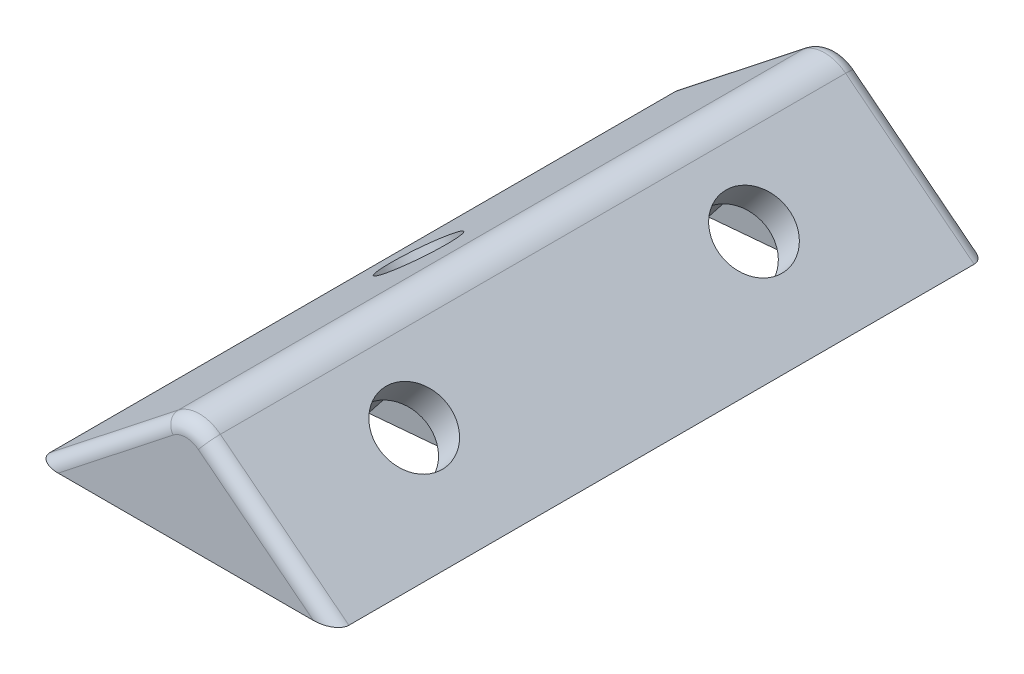
ISO-10303-21;
HEADER;
FILE_DESCRIPTION(('STEP AP214'),'2;1');
FILE_NAME('part.step','',(''),(''),'','','');
FILE_SCHEMA(('AUTOMOTIVE_DESIGN { 1 0 10303 214 1 1 1 1 }'));
ENDSEC;
DATA;
#1=APPLICATION_CONTEXT('core data for automotive mechanical design processes');
#2=APPLICATION_PROTOCOL_DEFINITION('international standard','automotive_design',2000,#1);
#3=PRODUCT_CONTEXT('',#1,'mechanical');
#4=PRODUCT('Part','Part','',(#3));
#5=PRODUCT_RELATED_PRODUCT_CATEGORY('part','',(#4));
#6=PRODUCT_DEFINITION_FORMATION('','',#4);
#7=PRODUCT_DEFINITION_CONTEXT('part definition',#1,'design');
#8=PRODUCT_DEFINITION('design','',#6,#7);
#9=PRODUCT_DEFINITION_SHAPE('','',#8);
#10=(LENGTH_UNIT() NAMED_UNIT(*) SI_UNIT(.MILLI.,.METRE.));
#11=(NAMED_UNIT(*) PLANE_ANGLE_UNIT() SI_UNIT($,.RADIAN.));
#12=(NAMED_UNIT(*) SI_UNIT($,.STERADIAN.) SOLID_ANGLE_UNIT());
#13=UNCERTAINTY_MEASURE_WITH_UNIT(LENGTH_MEASURE(1.E-05),#10,'distance_accuracy_value','');
#14=(GEOMETRIC_REPRESENTATION_CONTEXT(3) GLOBAL_UNCERTAINTY_ASSIGNED_CONTEXT((#13)) GLOBAL_UNIT_ASSIGNED_CONTEXT((#10,
#11,#12)) REPRESENTATION_CONTEXT('',''));
#15=CARTESIAN_POINT('',(0.,0.,0.));
#16=DIRECTION('',(0.,0.,1.));
#17=DIRECTION('',(1.,0.,0.));
#18=AXIS2_PLACEMENT_3D('',#15,#16,#17);
#19=CARTESIAN_POINT('',(-11.,-6.35085296108593,48.));
#20=DIRECTION('',(0.,1.,0.));
#21=DIRECTION('',(-1.,0.,0.));
#22=AXIS2_PLACEMENT_3D('',#19,#20,#21);
#23=PLANE('',#22);
#24=DIRECTION('',(0.690151317423896,0.,0.723665087632436));
#25=VECTOR('',#24,1.);
#26=CARTESIAN_POINT('',(17.2916140113125,-6.35085296108573,21.0186034732782));
#27=LINE('',#26,#25);
#28=CARTESIAN_POINT('',(4.11313500001594,-6.35085296108582,7.20017709662519));
#29=VERTEX_POINT('',#28);
#30=CARTESIAN_POINT('',(6.95854811567262,-6.3508529610858,10.1837635648482));
#31=VERTEX_POINT('',#30);
#32=EDGE_CURVE('E348',#29,#31,#27,.T.);
#33=ORIENTED_EDGE('',*,*,#32,.F.);
#34=DIRECTION('',(0.995581366656458,0.,-0.0939028347093871));
#35=VECTOR('',#34,1.);
#36=CARTESIAN_POINT('',(-14.6810265433523,-6.35085296108595,8.97283486626122));
#37=LINE('',#36,#35);
#38=CARTESIAN_POINT('',(-1.79639451138789,-6.35085296108586,7.75756154706267));
#39=VERTEX_POINT('',#38);
#40=EDGE_CURVE('E346',#39,#29,#37,.T.);
#41=ORIENTED_EDGE('',*,*,#40,.F.);
#42=DIRECTION('',(0.478072627834425,0.,-0.878320307470735));
#43=VECTOR('',#42,1.);
#44=CARTESIAN_POINT('',(-20.7977462059468,-6.35085296108599,42.6670545634767));
#45=LINE('',#44,#43);
#46=CARTESIAN_POINT('',(-4.13680223867652,-6.35085296108588,12.0573844504375));
#47=VERTEX_POINT('',#46);
#48=EDGE_CURVE('E344',#47,#39,#45,.T.);
#49=ORIENTED_EDGE('',*,*,#48,.F.);
#50=DIRECTION('',(-0.690151317423896,0.,-0.723665087632436));
#51=VECTOR('',#50,1.);
#52=CARTESIAN_POINT('',(10.5453188812956,-6.35085296108578,27.4524698450057));
#53=LINE('',#52,#51);
#54=CARTESIAN_POINT('',(-0.567680454561351,-6.35085296108586,15.7998229033748));
#55=VERTEX_POINT('',#54);
#56=EDGE_CURVE('E342',#55,#47,#53,.T.);
#57=ORIENTED_EDGE('',*,*,#56,.F.);
#58=DIRECTION('',(-0.995581366656458,0.,0.0939028347093877));
#59=VECTOR('',#58,1.);
#60=CARTESIAN_POINT('',(-13.9183378332725,-6.35085296108595,17.0590515461376));
#61=LINE('',#60,#59);
#62=CARTESIAN_POINT('',(5.34184905684248,-6.35085296108581,15.2424384529373));
#63=VERTEX_POINT('',#62);
#64=EDGE_CURVE('E340',#63,#55,#61,.T.);
#65=ORIENTED_EDGE('',*,*,#64,.F.);
#66=DIRECTION('',(-0.478072627834426,0.,0.878320307470735));
#67=VECTOR('',#66,1.);
#68=CARTESIAN_POINT('',(-12.1480662125865,-6.35085296108593,47.3751037901427));
#69=LINE('',#68,#67);
#70=CARTESIAN_POINT('',(6.95854811567262,-6.3508529610858,12.2722211015036));
#71=VERTEX_POINT('',#70);
#72=EDGE_CURVE('E336',#71,#63,#69,.T.);
#73=ORIENTED_EDGE('',*,*,#72,.F.);
#74=DIRECTION('',(0.,0.,-1.));
#75=VECTOR('',#74,1.);
#76=CARTESIAN_POINT('',(6.95854811567259,-6.3508529610858,48.));
#77=LINE('',#76,#75);
#78=EDGE_CURVE('E307',#71,#31,#77,.T.);
#79=ORIENTED_EDGE('',*,*,#78,.T.);
#80=EDGE_LOOP('',(#33,#41,#49,#57,#65,#73,#79));
#81=FACE_BOUND('',#80,.T.);
#82=DIRECTION('',(0.910679468583373,0.,-0.413113671403774));
#83=VECTOR('',#82,1.);
#84=CARTESIAN_POINT('',(-20.6481802324042,-6.35085296108599,26.7312784469563));
#85=LINE('',#84,#83);
#86=CARTESIAN_POINT('',(-6.95854811567258,-6.3508529610859,20.5212183994762));
#87=VERTEX_POINT('',#86);
#88=CARTESIAN_POINT('',(-4.31818181818178,-6.35085296108588,19.323462819564));
#89=VERTEX_POINT('',#88);
#90=EDGE_CURVE('E235',#87,#89,#85,.T.);
#91=ORIENTED_EDGE('',*,*,#90,.F.);
#92=DIRECTION('',(0.,0.,1.));
#93=VECTOR('',#92,1.);
#94=CARTESIAN_POINT('',(-6.95854811567258,-6.3508529610859,48.));
#95=LINE('',#94,#93);
#96=CARTESIAN_POINT('',(-6.95854811567258,-6.3508529610859,22.3916562207141));
#97=VERTEX_POINT('',#96);
#98=EDGE_CURVE('E218',#87,#97,#95,.T.);
#99=ORIENTED_EDGE('',*,*,#98,.T.);
#100=CARTESIAN_POINT('',(-4.31818181818177,-6.35085296108588,24.));
#101=DIRECTION('',(0.,1.,0.));
#102=DIRECTION('',(-1.,0.,0.));
#103=AXIS2_PLACEMENT_3D('',#100,#101,#102);
#104=ELLIPSE('',#103,3.34090909090909,2.625);
#105=CARTESIAN_POINT('',(-6.95854811567258,-6.3508529610859,25.6083437792859));
#106=VERTEX_POINT('',#105);
#107=EDGE_CURVE('E319',#97,#106,#104,.T.);
#108=ORIENTED_EDGE('',*,*,#107,.T.);
#109=CARTESIAN_POINT('',(-6.95854811567258,-6.3508529610859,27.4787816005238));
#110=VERTEX_POINT('',#109);
#111=EDGE_CURVE('E236',#106,#110,#95,.T.);
#112=ORIENTED_EDGE('',*,*,#111,.T.);
#113=DIRECTION('',(-0.910679468583373,0.,-0.413113671403774));
#114=VECTOR('',#113,1.);
#115=CARTESIAN_POINT('',(-2.58990157295544,-6.35085296108587,29.4605410170775));
#116=LINE('',#115,#114);
#117=CARTESIAN_POINT('',(-4.31818181818178,-6.35085296108588,28.676537180436));
#118=VERTEX_POINT('',#117);
#119=EDGE_CURVE('E369',#118,#110,#116,.T.);
#120=ORIENTED_EDGE('',*,*,#119,.F.);
#121=DIRECTION('',(-0.910679468583373,0.,0.413113671403774));
#122=VECTOR('',#121,1.);
#123=CARTESIAN_POINT('',(-17.1294214171714,-6.35085296108597,34.4881299620377));
#124=LINE('',#123,#122);
#125=CARTESIAN_POINT('',(0.83636363636368,-6.35085296108584,26.338268590218));
#126=VERTEX_POINT('',#125);
#127=EDGE_CURVE('E371',#126,#118,#124,.T.);
#128=ORIENTED_EDGE('',*,*,#127,.F.);
#129=DIRECTION('',(0.,0.,1.));
#130=VECTOR('',#129,1.);
#131=CARTESIAN_POINT('',(0.83636363636368,-6.35085296108584,48.));
#132=LINE('',#131,#130);
#133=CARTESIAN_POINT('',(0.83636363636368,-6.35085296108584,21.661731409782));
#134=VERTEX_POINT('',#133);
#135=EDGE_CURVE('E373',#134,#126,#132,.T.);
#136=ORIENTED_EDGE('',*,*,#135,.F.);
#137=DIRECTION('',(0.910679468583373,0.,0.413113671403774));
#138=VECTOR('',#137,1.);
#139=CARTESIAN_POINT('',(0.928857242277288,-6.35085296108584,21.7036895019962));
#140=LINE('',#139,#138);
#141=EDGE_CURVE('E375',#89,#134,#140,.T.);
#142=ORIENTED_EDGE('',*,*,#141,.F.);
#143=EDGE_LOOP('',(#91,#99,#108,#112,#120,#128,#136,#142));
#144=FACE_BOUND('',#143,.T.);
#145=DIRECTION('',(1.,0.,0.));
#146=VECTOR('',#145,1.);
#147=CARTESIAN_POINT('',(-11.,-6.35085296108593,48.));
#148=LINE('',#147,#146);
#149=CARTESIAN_POINT('',(-9.383419246269,-6.35085296108591,48.));
#150=VERTEX_POINT('',#149);
#151=CARTESIAN_POINT('',(9.38341924626905,-6.35085296108578,48.));
#152=VERTEX_POINT('',#151);
#153=EDGE_CURVE('E320',#150,#152,#148,.T.);
#154=ORIENTED_EDGE('',*,*,#153,.F.);
#155=CARTESIAN_POINT('',(-9.383419246269,-6.35085296108592,47.));
#156=DIRECTION('',(0.,1.,0.));
#157=DIRECTION('',(1.,0.,0.));
#158=AXIS2_PLACEMENT_3D('',#155,#156,#157);
#159=ELLIPSE('',#158,1.61658075373095,1.);
#160=CARTESIAN_POINT('',(-11.,-6.35085296108593,47.));
#161=VERTEX_POINT('',#160);
#162=EDGE_CURVE('E411',#150,#161,#159,.F.);
#163=ORIENTED_EDGE('',*,*,#162,.T.);
#164=DIRECTION('',(0.,0.,-1.));
#165=VECTOR('',#164,1.);
#166=CARTESIAN_POINT('',(-11.,-6.35085296108593,48.));
#167=LINE('',#166,#165);
#168=CARTESIAN_POINT('',(-11.,-6.35085296108593,1.));
#169=VERTEX_POINT('',#168);
#170=EDGE_CURVE('E328',#161,#169,#167,.T.);
#171=ORIENTED_EDGE('',*,*,#170,.T.);
#172=CARTESIAN_POINT('',(-9.383419246269,-6.35085296108592,1.));
#173=DIRECTION('',(0.,1.,0.));
#174=DIRECTION('',(-1.,0.,0.));
#175=AXIS2_PLACEMENT_3D('',#172,#173,#174);
#176=ELLIPSE('',#175,1.61658075373095,1.);
#177=CARTESIAN_POINT('',(-9.383419246269,-6.35085296108591,0.));
#178=VERTEX_POINT('',#177);
#179=EDGE_CURVE('E384',#169,#178,#176,.F.);
#180=ORIENTED_EDGE('',*,*,#179,.T.);
#181=DIRECTION('',(1.,0.,0.));
#182=VECTOR('',#181,1.);
#183=CARTESIAN_POINT('',(-11.,-6.35085296108593,0.));
#184=LINE('',#183,#182);
#185=CARTESIAN_POINT('',(9.38341924626905,-6.35085296108578,0.));
#186=VERTEX_POINT('',#185);
#187=EDGE_CURVE('E324',#178,#186,#184,.T.);
#188=ORIENTED_EDGE('',*,*,#187,.T.);
#189=CARTESIAN_POINT('',(9.38341924626905,-6.35085296108578,1.));
#190=DIRECTION('',(0.,1.,0.));
#191=DIRECTION('',(-1.,0.,0.));
#192=AXIS2_PLACEMENT_3D('',#189,#190,#191);
#193=ELLIPSE('',#192,1.61658075373095,1.);
#194=CARTESIAN_POINT('',(11.,-6.35085296108577,1.));
#195=VERTEX_POINT('',#194);
#196=EDGE_CURVE('E381',#186,#195,#193,.F.);
#197=ORIENTED_EDGE('',*,*,#196,.T.);
#198=DIRECTION('',(0.,0.,-1.));
#199=VECTOR('',#198,1.);
#200=CARTESIAN_POINT('',(11.,-6.35085296108577,48.));
#201=LINE('',#200,#199);
#202=CARTESIAN_POINT('',(11.,-6.35085296108577,47.));
#203=VERTEX_POINT('',#202);
#204=EDGE_CURVE('E323',#203,#195,#201,.T.);
#205=ORIENTED_EDGE('',*,*,#204,.F.);
#206=CARTESIAN_POINT('',(9.38341924626905,-6.35085296108578,47.));
#207=DIRECTION('',(0.,1.,0.));
#208=DIRECTION('',(1.,0.,0.));
#209=AXIS2_PLACEMENT_3D('',#206,#207,#208);
#210=ELLIPSE('',#209,1.61658075373095,1.);
#211=EDGE_CURVE('E409',#203,#152,#210,.F.);
#212=ORIENTED_EDGE('',*,*,#211,.T.);
#213=EDGE_LOOP('',(#154,#163,#171,#180,#188,#197,#205,#212));
#214=FACE_BOUND('',#213,.T.);
#215=DIRECTION('',(0.690151317423895,0.,0.723665087632436));
#216=VECTOR('',#215,1.);
#217=CARTESIAN_POINT('',(4.80565367123241,-6.35085296108582,32.9263244968267));
#218=LINE('',#217,#216);
#219=CARTESIAN_POINT('',(4.11313500001593,-6.35085296108582,32.2001770966252));
#220=VERTEX_POINT('',#219);
#221=CARTESIAN_POINT('',(6.95854811567262,-6.3508529610858,35.1837635648481));
#222=VERTEX_POINT('',#221);
#223=EDGE_CURVE('E363',#220,#222,#218,.T.);
#224=ORIENTED_EDGE('',*,*,#223,.F.);
#225=DIRECTION('',(0.995581366656458,0.,-0.0939028347093896));
#226=VECTOR('',#225,1.);
#227=CARTESIAN_POINT('',(-12.3438287305302,-6.35085296108594,33.7523913070998));
#228=LINE('',#227,#226);
#229=CARTESIAN_POINT('',(-1.79639451138788,-6.35085296108586,32.7575615470627));
#230=VERTEX_POINT('',#229);
#231=EDGE_CURVE('E361',#230,#220,#228,.T.);
#232=ORIENTED_EDGE('',*,*,#231,.F.);
#233=DIRECTION('',(0.478072627834427,0.,-0.878320307470735));
#234=VECTOR('',#233,1.);
#235=CARTESIAN_POINT('',(-10.300223769125,-6.35085296108592,48.3808905005895));
#236=LINE('',#235,#234);
#237=CARTESIAN_POINT('',(-4.13680223867652,-6.35085296108588,37.0573844504375));
#238=VERTEX_POINT('',#237);
#239=EDGE_CURVE('E359',#238,#230,#236,.T.);
#240=ORIENTED_EDGE('',*,*,#239,.F.);
#241=DIRECTION('',(-0.690151317423897,0.,-0.723665087632435));
#242=VECTOR('',#241,1.);
#243=CARTESIAN_POINT('',(-1.94064145878454,-6.35085296108586,39.3601908685542));
#244=LINE('',#243,#242);
#245=CARTESIAN_POINT('',(-0.567680454561334,-6.35085296108585,40.7998229033748));
#246=VERTEX_POINT('',#245);
#247=EDGE_CURVE('E357',#246,#238,#244,.T.);
#248=ORIENTED_EDGE('',*,*,#247,.F.);
#249=DIRECTION('',(-0.995581366656458,0.,0.0939028347093872));
#250=VECTOR('',#249,1.);
#251=CARTESIAN_POINT('',(-11.5811400204503,-6.35085296108593,41.8386079869762));
#252=LINE('',#251,#250);
#253=CARTESIAN_POINT('',(5.34184905684248,-6.35085296108581,40.2424384529373));
#254=VERTEX_POINT('',#253);
#255=EDGE_CURVE('E355',#254,#246,#252,.T.);
#256=ORIENTED_EDGE('',*,*,#255,.F.);
#257=DIRECTION('',(-0.478072627834426,0.,0.878320307470735));
#258=VECTOR('',#257,1.);
#259=CARTESIAN_POINT('',(-1.6505437757646,-6.35085296108586,53.0889397272555));
#260=LINE('',#259,#258);
#261=CARTESIAN_POINT('',(6.95854811567262,-6.3508529610858,37.2722211015036));
#262=VERTEX_POINT('',#261);
#263=EDGE_CURVE('E351',#262,#254,#260,.T.);
#264=ORIENTED_EDGE('',*,*,#263,.F.);
#265=DIRECTION('',(0.,0.,-1.));
#266=VECTOR('',#265,1.);
#267=CARTESIAN_POINT('',(6.95854811567262,-6.3508529610858,48.));
#268=LINE('',#267,#266);
#269=EDGE_CURVE('E275',#262,#222,#268,.T.);
#270=ORIENTED_EDGE('',*,*,#269,.T.);
#271=EDGE_LOOP('',(#224,#232,#240,#248,#256,#264,#270));
#272=FACE_BOUND('',#271,.T.);
#273=ADVANCED_FACE('F37',(#81,#144,#214,#272),#23,.F.);
#274=CARTESIAN_POINT('',(11.,-6.35085296108577,48.));
#275=DIRECTION('',(-0.618589574131738,-0.785714285714289,0.));
#276=DIRECTION('',(0.785714285714289,-0.618589574131738,0.));
#277=AXIS2_PLACEMENT_3D('',#274,#275,#276);
#278=PLANE('',#277);
#279=CARTESIAN_POINT('',(5.30357142857143,-1.86607854863069,36.5));
#280=DIRECTION('',(0.618589574131738,0.785714285714289,0.));
#281=DIRECTION('',(-0.785714285714289,0.618589574131738,0.));
#282=AXIS2_PLACEMENT_3D('',#279,#280,#281);
#283=CIRCLE('',#282,2.625);
#284=CARTESIAN_POINT('',(3.24107142857142,-0.242280916534877,36.5));
#285=VERTEX_POINT('',#284);
#286=EDGE_CURVE('E310',#285,#285,#283,.T.);
#287=ORIENTED_EDGE('',*,*,#286,.F.);
#288=EDGE_LOOP('',(#287));
#289=FACE_BOUND('',#288,.T.);
#290=CARTESIAN_POINT('',(5.30357142857143,-1.86607854863069,11.5));
#291=DIRECTION('',(0.618589574131738,0.785714285714289,0.));
#292=DIRECTION('',(-0.785714285714289,0.618589574131738,0.));
#293=AXIS2_PLACEMENT_3D('',#290,#291,#292);
#294=CIRCLE('',#293,2.625);
#295=CARTESIAN_POINT('',(3.24107142857142,-0.242280916534878,11.5));
#296=VERTEX_POINT('',#295);
#297=EDGE_CURVE('E313',#296,#296,#294,.T.);
#298=ORIENTED_EDGE('',*,*,#297,.F.);
#299=EDGE_LOOP('',(#298));
#300=FACE_BOUND('',#299,.T.);
#301=DIRECTION('',(0.,0.,-1.));
#302=VECTOR('',#301,1.);
#303=CARTESIAN_POINT('',(1.54647393532935,1.09186860922608,48.));
#304=LINE('',#303,#302);
#305=CARTESIAN_POINT('',(1.54647393532935,1.09186860922608,1.));
#306=VERTEX_POINT('',#305);
#307=CARTESIAN_POINT('',(1.54647393532935,1.09186860922608,47.));
#308=VERTEX_POINT('',#307);
#309=EDGE_CURVE('E334',#306,#308,#304,.F.);
#310=ORIENTED_EDGE('',*,*,#309,.T.);
#311=DIRECTION('',(-0.785714285714289,0.618589574131738,0.));
#312=VECTOR('',#311,1.);
#313=CARTESIAN_POINT('',(11.,-6.35085296108577,47.));
#314=LINE('',#313,#312);
#315=EDGE_CURVE('E11',#308,#203,#314,.F.);
#316=ORIENTED_EDGE('',*,*,#315,.T.);
#317=ORIENTED_EDGE('',*,*,#204,.T.);
#318=DIRECTION('',(-0.785714285714289,0.618589574131738,0.));
#319=VECTOR('',#318,1.);
#320=CARTESIAN_POINT('',(11.,-6.35085296108577,1.));
#321=LINE('',#320,#319);
#322=EDGE_CURVE('E395',#195,#306,#321,.T.);
#323=ORIENTED_EDGE('',*,*,#322,.T.);
#324=EDGE_LOOP('',(#310,#316,#317,#323));
#325=FACE_BOUND('',#324,.T.);
#326=ADVANCED_FACE('F430',(#289,#300,#325),#278,.F.);
#327=CARTESIAN_POINT('',(0.,2.30940107675854,48.));
#328=DIRECTION('',(0.618589574131748,-0.785714285714281,0.));
#329=DIRECTION('',(0.785714285714281,0.618589574131748,0.));
#330=AXIS2_PLACEMENT_3D('',#327,#328,#329);
#331=PLANE('',#330);
#332=CARTESIAN_POINT('',(-6.87499999999998,-3.10325769689425,24.));
#333=DIRECTION('',(-0.618589574131748,0.785714285714281,0.));
#334=DIRECTION('',(-0.785714285714281,-0.618589574131748,0.));
#335=AXIS2_PLACEMENT_3D('',#332,#333,#334);
#336=CIRCLE('',#335,2.625);
#337=CARTESIAN_POINT('',(-8.93749999999997,-4.72705532899009,24.));
#338=VERTEX_POINT('',#337);
#339=EDGE_CURVE('E316',#338,#338,#336,.T.);
#340=ORIENTED_EDGE('',*,*,#339,.F.);
#341=EDGE_LOOP('',(#340));
#342=FACE_BOUND('',#341,.T.);
#343=ORIENTED_EDGE('',*,*,#170,.F.);
#344=DIRECTION('',(-0.785714285714281,-0.618589574131748,0.));
#345=VECTOR('',#344,1.);
#346=CARTESIAN_POINT('',(-1.54647393532937,1.09186860922606,47.));
#347=LINE('',#346,#345);
#348=CARTESIAN_POINT('',(-1.54647393532937,1.09186860922606,47.));
#349=VERTEX_POINT('',#348);
#350=EDGE_CURVE('E61',#161,#349,#347,.F.);
#351=ORIENTED_EDGE('',*,*,#350,.T.);
#352=DIRECTION('',(0.,0.,-1.));
#353=VECTOR('',#352,1.);
#354=CARTESIAN_POINT('',(-1.54647393532937,1.09186860922606,48.));
#355=LINE('',#354,#353);
#356=CARTESIAN_POINT('',(-1.54647393532937,1.09186860922606,1.));
#357=VERTEX_POINT('',#356);
#358=EDGE_CURVE('E330',#349,#357,#355,.T.);
#359=ORIENTED_EDGE('',*,*,#358,.T.);
#360=DIRECTION('',(-0.785714285714281,-0.618589574131748,0.));
#361=VECTOR('',#360,1.);
#362=CARTESIAN_POINT('',(0.,2.30940107675854,1.));
#363=LINE('',#362,#361);
#364=EDGE_CURVE('E378',#357,#169,#363,.T.);
#365=ORIENTED_EDGE('',*,*,#364,.T.);
#366=EDGE_LOOP('',(#343,#351,#359,#365));
#367=FACE_BOUND('',#366,.T.);
#368=ADVANCED_FACE('F452',(#342,#367),#331,.F.);
#369=CARTESIAN_POINT('',(0.,0.,48.));
#370=DIRECTION('',(0.,0.,1.));
#371=DIRECTION('',(1.,0.,0.));
#372=AXIS2_PLACEMENT_3D('',#369,#370,#371);
#373=PLANE('',#372);
#374=CARTESIAN_POINT('',(0.,-0.872417105059645,48.));
#375=DIRECTION('',(0.,0.,1.));
#376=DIRECTION('',(1.,0.,0.));
#377=AXIS2_PLACEMENT_3D('',#374,#375,#376);
#378=CIRCLE('',#377,1.5);
#379=CARTESIAN_POINT('',(0.927884361197609,0.306154323511787,48.));
#380=VERTEX_POINT('',#379);
#381=CARTESIAN_POINT('',(-0.92788436119762,0.306154323511776,48.));
#382=VERTEX_POINT('',#381);
#383=EDGE_CURVE('E404',#380,#382,#378,.T.);
#384=ORIENTED_EDGE('',*,*,#383,.T.);
#385=DIRECTION('',(-0.785714285714281,-0.618589574131748,0.));
#386=VECTOR('',#385,1.);
#387=CARTESIAN_POINT('',(-10.3814104258682,-7.13656724680021,48.));
#388=LINE('',#387,#386);
#389=EDGE_CURVE('E406',#382,#150,#388,.T.);
#390=ORIENTED_EDGE('',*,*,#389,.T.);
#391=ORIENTED_EDGE('',*,*,#153,.T.);
#392=DIRECTION('',(-0.785714285714289,0.618589574131738,0.));
#393=VECTOR('',#392,1.);
#394=CARTESIAN_POINT('',(0.92788436119761,0.306154323511787,48.));
#395=LINE('',#394,#393);
#396=EDGE_CURVE('E397',#152,#380,#395,.T.);
#397=ORIENTED_EDGE('',*,*,#396,.T.);
#398=EDGE_LOOP('',(#384,#390,#391,#397));
#399=FACE_BOUND('',#398,.T.);
#400=ADVANCED_FACE('F455',(#399),#373,.T.);
#401=CARTESIAN_POINT('',(0.,0.,0.));
#402=DIRECTION('',(0.,0.,1.));
#403=DIRECTION('',(1.,0.,0.));
#404=AXIS2_PLACEMENT_3D('',#401,#402,#403);
#405=PLANE('',#404);
#406=ORIENTED_EDGE('',*,*,#187,.F.);
#407=DIRECTION('',(-0.785714285714281,-0.618589574131748,0.));
#408=VECTOR('',#407,1.);
#409=CARTESIAN_POINT('',(-0.503859405460118,0.639987399427463,0.));
#410=LINE('',#409,#408);
#411=CARTESIAN_POINT('',(-0.92788436119762,0.306154323511776,0.));
#412=VERTEX_POINT('',#411);
#413=EDGE_CURVE('E390',#178,#412,#410,.F.);
#414=ORIENTED_EDGE('',*,*,#413,.T.);
#415=CARTESIAN_POINT('',(0.,-0.872417105059645,0.));
#416=DIRECTION('',(0.,0.,1.));
#417=DIRECTION('',(1.,0.,0.));
#418=AXIS2_PLACEMENT_3D('',#415,#416,#417);
#419=CIRCLE('',#418,1.5);
#420=CARTESIAN_POINT('',(0.927884361197609,0.306154323511787,0.));
#421=VERTEX_POINT('',#420);
#422=EDGE_CURVE('E388',#412,#421,#419,.F.);
#423=ORIENTED_EDGE('',*,*,#422,.T.);
#424=DIRECTION('',(-0.785714285714289,0.618589574131738,0.));
#425=VECTOR('',#424,1.);
#426=CARTESIAN_POINT('',(0.503859405460107,0.639987399427465,0.));
#427=LINE('',#426,#425);
#428=EDGE_CURVE('E386',#421,#186,#427,.F.);
#429=ORIENTED_EDGE('',*,*,#428,.T.);
#430=EDGE_LOOP('',(#406,#414,#423,#429));
#431=FACE_BOUND('',#430,.T.);
#432=ADVANCED_FACE('F457',(#431),#405,.F.);
#433=CARTESIAN_POINT('',(1.54336734693893,-13.7960203354572,24.));
#434=DIRECTION('',(-0.618589574131747,0.785714285714281,0.));
#435=DIRECTION('',(-0.785714285714281,-0.618589574131747,0.));
#436=AXIS2_PLACEMENT_3D('',#433,#434,#435);
#437=CYLINDRICAL_SURFACE('',#436,2.625);
#438=ORIENTED_EDGE('',*,*,#339,.T.);
#439=EDGE_LOOP('',(#438));
#440=FACE_BOUND('',#439,.T.);
#441=ORIENTED_EDGE('',*,*,#107,.F.);
#442=CARTESIAN_POINT('',(-5.32852606467061,-5.06754341117995,24.));
#443=DIRECTION('',(-0.618589574131748,0.785714285714281,0.));
#444=DIRECTION('',(-0.785714285714281,-0.618589574131748,0.));
#445=AXIS2_PLACEMENT_3D('',#442,#443,#444);
#446=CIRCLE('',#445,2.625);
#447=EDGE_CURVE('E366',#97,#106,#446,.F.);
#448=ORIENTED_EDGE('',*,*,#447,.T.);
#449=EDGE_LOOP('',(#441,#448));
#450=FACE_BOUND('',#449,.T.);
#451=ADVANCED_FACE('F463',(#440,#450),#437,.F.);
#452=CARTESIAN_POINT('',(-3.1147959183673,-12.5588411871937,11.5));
#453=DIRECTION('',(0.618589574131738,0.785714285714289,0.));
#454=DIRECTION('',(-0.785714285714289,0.618589574131738,0.));
#455=AXIS2_PLACEMENT_3D('',#452,#453,#454);
#456=CYLINDRICAL_SURFACE('',#455,2.625);
#457=CARTESIAN_POINT('',(3.75709749324208,-3.83036426291642,11.5));
#458=DIRECTION('',(0.618589574131738,0.785714285714289,0.));
#459=DIRECTION('',(-0.785714285714289,0.618589574131738,0.));
#460=AXIS2_PLACEMENT_3D('',#457,#458,#459);
#461=CIRCLE('',#460,2.625);
#462=CARTESIAN_POINT('',(1.69459749324207,-2.2065666308206,11.5));
#463=VERTEX_POINT('',#462);
#464=EDGE_CURVE('E306',#463,#463,#461,.F.);
#465=ORIENTED_EDGE('',*,*,#464,.T.);
#466=EDGE_LOOP('',(#465));
#467=FACE_BOUND('',#466,.T.);
#468=ORIENTED_EDGE('',*,*,#297,.T.);
#469=EDGE_LOOP('',(#468));
#470=FACE_BOUND('',#469,.T.);
#471=ADVANCED_FACE('F674',(#467,#470),#456,.F.);
#472=CARTESIAN_POINT('',(-3.1147959183673,-12.5588411871937,36.5));
#473=DIRECTION('',(0.618589574131738,0.785714285714289,0.));
#474=DIRECTION('',(-0.785714285714289,0.618589574131738,0.));
#475=AXIS2_PLACEMENT_3D('',#472,#473,#474);
#476=CYLINDRICAL_SURFACE('',#475,2.625);
#477=CARTESIAN_POINT('',(3.75709749324208,-3.83036426291642,36.5));
#478=DIRECTION('',(0.618589574131738,0.785714285714289,0.));
#479=DIRECTION('',(-0.785714285714289,0.618589574131738,0.));
#480=AXIS2_PLACEMENT_3D('',#477,#478,#479);
#481=CIRCLE('',#480,2.625);
#482=CARTESIAN_POINT('',(1.69459749324207,-2.2065666308206,36.5));
#483=VERTEX_POINT('',#482);
#484=EDGE_CURVE('E274',#483,#483,#481,.F.);
#485=ORIENTED_EDGE('',*,*,#484,.T.);
#486=EDGE_LOOP('',(#485));
#487=FACE_BOUND('',#486,.T.);
#488=ORIENTED_EDGE('',*,*,#286,.T.);
#489=EDGE_LOOP('',(#488));
#490=FACE_BOUND('',#489,.T.);
#491=ADVANCED_FACE('F483',(#487,#490),#476,.F.);
#492=CARTESIAN_POINT('',(0.,-0.872417105059645,48.));
#493=DIRECTION('',(0.,0.,-1.));
#494=DIRECTION('',(-1.,0.,0.));
#495=AXIS2_PLACEMENT_3D('',#492,#493,#494);
#496=CYLINDRICAL_SURFACE('',#495,2.5);
#497=ORIENTED_EDGE('',*,*,#358,.F.);
#498=CARTESIAN_POINT('',(0.,-0.872417105059645,47.));
#499=DIRECTION('',(0.,0.,1.));
#500=DIRECTION('',(1.,0.,0.));
#501=AXIS2_PLACEMENT_3D('',#498,#499,#500);
#502=CIRCLE('',#501,2.5);
#503=EDGE_CURVE('E46',#349,#308,#502,.F.);
#504=ORIENTED_EDGE('',*,*,#503,.T.);
#505=ORIENTED_EDGE('',*,*,#309,.F.);
#506=CARTESIAN_POINT('',(0.,-0.872417105059645,1.));
#507=DIRECTION('',(0.,0.,1.));
#508=DIRECTION('',(1.,0.,0.));
#509=AXIS2_PLACEMENT_3D('',#506,#507,#508);
#510=CIRCLE('',#509,2.5);
#511=EDGE_CURVE('E392',#306,#357,#510,.T.);
#512=ORIENTED_EDGE('',*,*,#511,.T.);
#513=EDGE_LOOP('',(#497,#504,#505,#512));
#514=FACE_BOUND('',#513,.T.);
#515=ADVANCED_FACE('F442',(#514),#496,.T.);
#516=CARTESIAN_POINT('',(7.40532744671077,-6.7026004615993,10.9426155495625));
#517=DIRECTION('',(-0.628774506098381,0.495031541393824,0.599655228865714));
#518=DIRECTION('',(0.690151317423894,0.,0.723665087632437));
#519=AXIS2_PLACEMENT_3D('',#516,#517,#518);
#520=PLANE('',#519);
#521=ORIENTED_EDGE('',*,*,#32,.T.);
#522=DIRECTION('',(-0.471157679823062,0.370940472649912,-0.800258462307028));
#523=VECTOR('',#522,1.);
#524=CARTESIAN_POINT('',(7.40532744671077,-6.7026004615993,10.9426155495625));
#525=LINE('',#524,#523);
#526=CARTESIAN_POINT('',(5.20194103917027,-4.9678835495235,7.20017709662519));
#527=VERTEX_POINT('',#526);
#528=EDGE_CURVE('E278',#31,#527,#525,.T.);
#529=ORIENTED_EDGE('',*,*,#528,.T.);
#530=DIRECTION('',(-0.618589574131738,-0.785714285714289,0.));
#531=VECTOR('',#530,1.);
#532=CARTESIAN_POINT('',(5.20194103917027,-4.9678835495235,7.20017709662519));
#533=LINE('',#532,#531);
#534=EDGE_CURVE('E303',#527,#29,#533,.T.);
#535=ORIENTED_EDGE('',*,*,#534,.T.);
#536=EDGE_LOOP('',(#521,#529,#535));
#537=FACE_BOUND('',#536,.T.);
#538=ADVANCED_FACE('F482',(#537),#520,.T.);
#539=CARTESIAN_POINT('',(5.20194103917027,-4.9678835495235,7.20017709662519));
#540=DIRECTION('',(0.093647266865716,-0.0737281019097182,0.992871772384214));
#541=DIRECTION('',(0.995581366656458,0.,-0.0939028347093876));
#542=AXIS2_PLACEMENT_3D('',#539,#540,#541);
#543=PLANE('',#542);
#544=ORIENTED_EDGE('',*,*,#40,.T.);
#545=ORIENTED_EDGE('',*,*,#534,.F.);
#546=DIRECTION('',(-0.780113535444743,0.614180126846575,0.119187430556365));
#547=VECTOR('',#546,1.);
#548=CARTESIAN_POINT('',(5.20194103917027,-4.9678835495235,7.20017709662519));
#549=LINE('',#548,#547);
#550=CARTESIAN_POINT('',(1.55371108570158,-2.09564735084061,7.75756154706266));
#551=VERTEX_POINT('',#550);
#552=EDGE_CURVE('E280',#527,#551,#549,.T.);
#553=ORIENTED_EDGE('',*,*,#552,.T.);
#554=DIRECTION('',(-0.618589574131738,-0.785714285714289,0.));
#555=VECTOR('',#554,1.);
#556=CARTESIAN_POINT('',(1.55371108570158,-2.09564735084061,7.75756154706266));
#557=LINE('',#556,#555);
#558=EDGE_CURVE('E300',#551,#39,#557,.T.);
#559=ORIENTED_EDGE('',*,*,#558,.T.);
#560=EDGE_LOOP('',(#544,#545,#553,#559));
#561=FACE_BOUND('',#560,.T.);
#562=ADVANCED_FACE('F649',(#561),#543,.T.);
#563=CARTESIAN_POINT('',(1.55371108570158,-2.09564735084061,7.75756154706266));
#564=DIRECTION('',(0.722421772964098,-0.568759643303542,0.3932165435185));
#565=DIRECTION('',(0.618589574131738,0.785714285714289,0.));
#566=AXIS2_PLACEMENT_3D('',#563,#564,#565);
#567=PLANE('',#566);
#568=ORIENTED_EDGE('',*,*,#48,.T.);
#569=ORIENTED_EDGE('',*,*,#558,.F.);
#570=DIRECTION('',(-0.30895585562168,0.243239654196663,0.919445892863394));
#571=VECTOR('',#570,1.);
#572=CARTESIAN_POINT('',(1.55371108570158,-2.09564735084061,7.75756154706266));
#573=LINE('',#572,#571);
#574=CARTESIAN_POINT('',(0.108867539773391,-0.958128064233529,12.0573844504375));
#575=VERTEX_POINT('',#574);
#576=EDGE_CURVE('E282',#551,#575,#573,.T.);
#577=ORIENTED_EDGE('',*,*,#576,.T.);
#578=DIRECTION('',(-0.618589574131738,-0.785714285714289,0.));
#579=VECTOR('',#578,1.);
#580=CARTESIAN_POINT('',(0.108867539773391,-0.958128064233529,12.0573844504375));
#581=LINE('',#580,#579);
#582=EDGE_CURVE('E297',#575,#47,#581,.T.);
#583=ORIENTED_EDGE('',*,*,#582,.T.);
#584=EDGE_LOOP('',(#568,#569,#577,#583));
#585=FACE_BOUND('',#584,.T.);
#586=ADVANCED_FACE('F641',(#585),#567,.T.);
#587=CARTESIAN_POINT('',(0.108867539773391,-0.958128064233529,12.0573844504375));
#588=DIRECTION('',(0.628774506098381,-0.495031541393824,-0.599655228865714));
#589=DIRECTION('',(-0.690151317423894,0.,-0.723665087632437));
#590=AXIS2_PLACEMENT_3D('',#587,#588,#589);
#591=PLANE('',#590);
#592=ORIENTED_EDGE('',*,*,#56,.T.);
#593=ORIENTED_EDGE('',*,*,#582,.F.);
#594=DIRECTION('',(0.471157679823063,-0.370940472649912,0.800258462307028));
#595=VECTOR('',#594,1.);
#596=CARTESIAN_POINT('',(0.108867539773391,-0.958128064233529,12.0573844504375));
#597=LINE('',#596,#595);
#598=CARTESIAN_POINT('',(2.31225394731389,-2.69284497630933,15.7998229033748));
#599=VERTEX_POINT('',#598);
#600=EDGE_CURVE('E284',#575,#599,#597,.T.);
#601=ORIENTED_EDGE('',*,*,#600,.T.);
#602=DIRECTION('',(-0.618589574131738,-0.785714285714289,0.));
#603=VECTOR('',#602,1.);
#604=CARTESIAN_POINT('',(2.31225394731389,-2.69284497630933,15.7998229033748));
#605=LINE('',#604,#603);
#606=EDGE_CURVE('E294',#599,#55,#605,.T.);
#607=ORIENTED_EDGE('',*,*,#606,.T.);
#608=EDGE_LOOP('',(#592,#593,#601,#607));
#609=FACE_BOUND('',#608,.T.);
#610=ADVANCED_FACE('F633',(#609),#591,.T.);
#611=CARTESIAN_POINT('',(2.31225394731389,-2.69284497630933,15.7998229033748));
#612=DIRECTION('',(-0.0936472668657167,0.0737281019097187,-0.992871772384214));
#613=DIRECTION('',(-0.995581366656458,0.,0.0939028347093883));
#614=AXIS2_PLACEMENT_3D('',#611,#612,#613);
#615=PLANE('',#614);
#616=ORIENTED_EDGE('',*,*,#64,.T.);
#617=ORIENTED_EDGE('',*,*,#606,.F.);
#618=DIRECTION('',(0.780113535444743,-0.614180126846575,-0.119187430556366));
#619=VECTOR('',#618,1.);
#620=CARTESIAN_POINT('',(2.31225394731389,-2.69284497630933,15.7998229033748));
#621=LINE('',#620,#619);
#622=CARTESIAN_POINT('',(5.96048390078258,-5.56508117499222,15.2424384529373));
#623=VERTEX_POINT('',#622);
#624=EDGE_CURVE('E286',#599,#623,#621,.T.);
#625=ORIENTED_EDGE('',*,*,#624,.T.);
#626=DIRECTION('',(-0.618589574131738,-0.785714285714289,0.));
#627=VECTOR('',#626,1.);
#628=CARTESIAN_POINT('',(5.96048390078258,-5.56508117499222,15.2424384529373));
#629=LINE('',#628,#627);
#630=EDGE_CURVE('E291',#623,#63,#629,.T.);
#631=ORIENTED_EDGE('',*,*,#630,.T.);
#632=EDGE_LOOP('',(#616,#617,#625,#631));
#633=FACE_BOUND('',#632,.T.);
#634=ADVANCED_FACE('F625',(#633),#615,.T.);
#635=CARTESIAN_POINT('',(5.96048390078258,-5.56508117499222,15.2424384529373));
#636=DIRECTION('',(-0.722421772964098,0.568759643303542,-0.393216543518501));
#637=DIRECTION('',(-0.618589574131738,-0.785714285714289,0.));
#638=AXIS2_PLACEMENT_3D('',#635,#636,#637);
#639=PLANE('',#638);
#640=ORIENTED_EDGE('',*,*,#72,.T.);
#641=ORIENTED_EDGE('',*,*,#630,.F.);
#642=DIRECTION('',(0.30895585562168,-0.243239654196664,-0.919445892863394));
#643=VECTOR('',#642,1.);
#644=CARTESIAN_POINT('',(5.96048390078258,-5.56508117499222,15.2424384529373));
#645=LINE('',#644,#643);
#646=EDGE_CURVE('E288',#623,#71,#645,.T.);
#647=ORIENTED_EDGE('',*,*,#646,.T.);
#648=EDGE_LOOP('',(#640,#641,#647));
#649=FACE_BOUND('',#648,.T.);
#650=ADVANCED_FACE('F617',(#649),#639,.T.);
#651=CARTESIAN_POINT('',(-0.4240249557375,-0.538584029143967,0.));
#652=DIRECTION('',(0.618589574131738,0.785714285714289,0.));
#653=DIRECTION('',(-0.785714285714289,0.618589574131738,0.));
#654=AXIS2_PLACEMENT_3D('',#651,#652,#653);
#655=PLANE('',#654);
#656=ORIENTED_EDGE('',*,*,#464,.F.);
#657=EDGE_LOOP('',(#656));
#658=FACE_BOUND('',#657,.T.);
#659=ORIENTED_EDGE('',*,*,#646,.F.);
#660=ORIENTED_EDGE('',*,*,#624,.F.);
#661=ORIENTED_EDGE('',*,*,#600,.F.);
#662=ORIENTED_EDGE('',*,*,#576,.F.);
#663=ORIENTED_EDGE('',*,*,#552,.F.);
#664=ORIENTED_EDGE('',*,*,#528,.F.);
#665=ORIENTED_EDGE('',*,*,#78,.F.);
#666=EDGE_LOOP('',(#659,#660,#661,#662,#663,#664,#665));
#667=FACE_BOUND('',#666,.T.);
#668=ADVANCED_FACE('F609',(#658,#667),#655,.F.);
#669=CARTESIAN_POINT('',(7.40532744671078,-6.7026004615993,35.9426155495625));
#670=DIRECTION('',(-0.628774506098381,0.495031541393824,0.599655228865713));
#671=DIRECTION('',(0.690151317423894,0.,0.723665087632438));
#672=AXIS2_PLACEMENT_3D('',#669,#670,#671);
#673=PLANE('',#672);
#674=ORIENTED_EDGE('',*,*,#223,.T.);
#675=DIRECTION('',(-0.471157679823062,0.370940472649911,-0.800258462307028));
#676=VECTOR('',#675,1.);
#677=CARTESIAN_POINT('',(7.40532744671078,-6.7026004615993,35.9426155495625));
#678=LINE('',#677,#676);
#679=CARTESIAN_POINT('',(5.20194103917027,-4.9678835495235,32.2001770966252));
#680=VERTEX_POINT('',#679);
#681=EDGE_CURVE('E246',#222,#680,#678,.T.);
#682=ORIENTED_EDGE('',*,*,#681,.T.);
#683=DIRECTION('',(-0.618589574131738,-0.785714285714289,0.));
#684=VECTOR('',#683,1.);
#685=CARTESIAN_POINT('',(5.20194103917027,-4.9678835495235,32.2001770966252));
#686=LINE('',#685,#684);
#687=EDGE_CURVE('E271',#680,#220,#686,.T.);
#688=ORIENTED_EDGE('',*,*,#687,.T.);
#689=EDGE_LOOP('',(#674,#682,#688));
#690=FACE_BOUND('',#689,.T.);
#691=ADVANCED_FACE('F601',(#690),#673,.T.);
#692=CARTESIAN_POINT('',(5.20194103917027,-4.9678835495235,32.2001770966252));
#693=DIRECTION('',(0.0936472668657185,-0.0737281019097201,0.992871772384214));
#694=DIRECTION('',(0.995581366656458,0.,-0.0939028347093901));
#695=AXIS2_PLACEMENT_3D('',#692,#693,#694);
#696=PLANE('',#695);
#697=ORIENTED_EDGE('',*,*,#231,.T.);
#698=ORIENTED_EDGE('',*,*,#687,.F.);
#699=DIRECTION('',(-0.780113535444743,0.614180126846575,0.119187430556369));
#700=VECTOR('',#699,1.);
#701=CARTESIAN_POINT('',(5.20194103917027,-4.9678835495235,32.2001770966252));
#702=LINE('',#701,#700);
#703=CARTESIAN_POINT('',(1.55371108570159,-2.09564735084061,32.7575615470627));
#704=VERTEX_POINT('',#703);
#705=EDGE_CURVE('E248',#680,#704,#702,.T.);
#706=ORIENTED_EDGE('',*,*,#705,.T.);
#707=DIRECTION('',(-0.618589574131738,-0.785714285714289,0.));
#708=VECTOR('',#707,1.);
#709=CARTESIAN_POINT('',(1.55371108570159,-2.09564735084061,32.7575615470627));
#710=LINE('',#709,#708);
#711=EDGE_CURVE('E268',#704,#230,#710,.T.);
#712=ORIENTED_EDGE('',*,*,#711,.T.);
#713=EDGE_LOOP('',(#697,#698,#706,#712));
#714=FACE_BOUND('',#713,.T.);
#715=ADVANCED_FACE('F593',(#714),#696,.T.);
#716=CARTESIAN_POINT('',(1.55371108570159,-2.09564735084061,32.7575615470627));
#717=DIRECTION('',(0.722421772964097,-0.568759643303542,0.393216543518501));
#718=DIRECTION('',(0.618589574131738,0.785714285714289,0.));
#719=AXIS2_PLACEMENT_3D('',#716,#717,#718);
#720=PLANE('',#719);
#721=ORIENTED_EDGE('',*,*,#239,.T.);
#722=ORIENTED_EDGE('',*,*,#711,.F.);
#723=DIRECTION('',(-0.308955855621681,0.243239654196664,0.919445892863393));
#724=VECTOR('',#723,1.);
#725=CARTESIAN_POINT('',(1.55371108570159,-2.09564735084061,32.7575615470627));
#726=LINE('',#725,#724);
#727=CARTESIAN_POINT('',(0.108867539773392,-0.958128064233531,37.0573844504375));
#728=VERTEX_POINT('',#727);
#729=EDGE_CURVE('E250',#704,#728,#726,.T.);
#730=ORIENTED_EDGE('',*,*,#729,.T.);
#731=DIRECTION('',(-0.618589574131738,-0.785714285714289,0.));
#732=VECTOR('',#731,1.);
#733=CARTESIAN_POINT('',(0.108867539773392,-0.958128064233531,37.0573844504375));
#734=LINE('',#733,#732);
#735=EDGE_CURVE('E265',#728,#238,#734,.T.);
#736=ORIENTED_EDGE('',*,*,#735,.T.);
#737=EDGE_LOOP('',(#721,#722,#730,#736));
#738=FACE_BOUND('',#737,.T.);
#739=ADVANCED_FACE('F585',(#738),#720,.T.);
#740=CARTESIAN_POINT('',(0.108867539773392,-0.958128064233531,37.0573844504375));
#741=DIRECTION('',(0.628774506098381,-0.495031541393823,-0.599655228865715));
#742=DIRECTION('',(-0.690151317423895,0.,-0.723665087632437));
#743=AXIS2_PLACEMENT_3D('',#740,#741,#742);
#744=PLANE('',#743);
#745=ORIENTED_EDGE('',*,*,#247,.T.);
#746=ORIENTED_EDGE('',*,*,#735,.F.);
#747=DIRECTION('',(0.471157679823063,-0.370940472649912,0.800258462307027));
#748=VECTOR('',#747,1.);
#749=CARTESIAN_POINT('',(0.108867539773392,-0.958128064233531,37.0573844504375));
#750=LINE('',#749,#748);
#751=CARTESIAN_POINT('',(2.31225394731389,-2.69284497630934,40.7998229033748));
#752=VERTEX_POINT('',#751);
#753=EDGE_CURVE('E252',#728,#752,#750,.T.);
#754=ORIENTED_EDGE('',*,*,#753,.T.);
#755=DIRECTION('',(-0.618589574131738,-0.785714285714289,0.));
#756=VECTOR('',#755,1.);
#757=CARTESIAN_POINT('',(2.31225394731389,-2.69284497630934,40.7998229033748));
#758=LINE('',#757,#756);
#759=EDGE_CURVE('E262',#752,#246,#758,.T.);
#760=ORIENTED_EDGE('',*,*,#759,.T.);
#761=EDGE_LOOP('',(#745,#746,#754,#760));
#762=FACE_BOUND('',#761,.T.);
#763=ADVANCED_FACE('F577',(#762),#744,.T.);
#764=CARTESIAN_POINT('',(2.31225394731389,-2.69284497630934,40.7998229033748));
#765=DIRECTION('',(-0.0936472668657161,0.0737281019097182,-0.992871772384214));
#766=DIRECTION('',(-0.995581366656458,0.,0.0939028347093877));
#767=AXIS2_PLACEMENT_3D('',#764,#765,#766);
#768=PLANE('',#767);
#769=ORIENTED_EDGE('',*,*,#255,.T.);
#770=ORIENTED_EDGE('',*,*,#759,.F.);
#771=DIRECTION('',(0.780113535444743,-0.614180126846575,-0.119187430556366));
#772=VECTOR('',#771,1.);
#773=CARTESIAN_POINT('',(2.31225394731389,-2.69284497630934,40.7998229033748));
#774=LINE('',#773,#772);
#775=CARTESIAN_POINT('',(5.96048390078258,-5.56508117499222,40.2424384529373));
#776=VERTEX_POINT('',#775);
#777=EDGE_CURVE('E254',#752,#776,#774,.T.);
#778=ORIENTED_EDGE('',*,*,#777,.T.);
#779=DIRECTION('',(-0.618589574131738,-0.785714285714289,0.));
#780=VECTOR('',#779,1.);
#781=CARTESIAN_POINT('',(5.96048390078258,-5.56508117499222,40.2424384529373));
#782=LINE('',#781,#780);
#783=EDGE_CURVE('E259',#776,#254,#782,.T.);
#784=ORIENTED_EDGE('',*,*,#783,.T.);
#785=EDGE_LOOP('',(#769,#770,#778,#784));
#786=FACE_BOUND('',#785,.T.);
#787=ADVANCED_FACE('F569',(#786),#768,.T.);
#788=CARTESIAN_POINT('',(5.96048390078258,-5.56508117499222,40.2424384529373));
#789=DIRECTION('',(-0.722421772964098,0.568759643303542,-0.393216543518501));
#790=DIRECTION('',(-0.618589574131738,-0.785714285714289,0.));
#791=AXIS2_PLACEMENT_3D('',#788,#789,#790);
#792=PLANE('',#791);
#793=ORIENTED_EDGE('',*,*,#263,.T.);
#794=ORIENTED_EDGE('',*,*,#783,.F.);
#795=DIRECTION('',(0.308955855621681,-0.243239654196664,-0.919445892863394));
#796=VECTOR('',#795,1.);
#797=CARTESIAN_POINT('',(5.96048390078258,-5.56508117499222,40.2424384529373));
#798=LINE('',#797,#796);
#799=EDGE_CURVE('E256',#776,#262,#798,.T.);
#800=ORIENTED_EDGE('',*,*,#799,.T.);
#801=EDGE_LOOP('',(#793,#794,#800));
#802=FACE_BOUND('',#801,.T.);
#803=ADVANCED_FACE('F561',(#802),#792,.T.);
#804=CARTESIAN_POINT('',(-0.42402495573751,-0.538584029143977,0.));
#805=DIRECTION('',(0.618589574131738,0.785714285714289,0.));
#806=DIRECTION('',(-0.785714285714289,0.618589574131738,0.));
#807=AXIS2_PLACEMENT_3D('',#804,#805,#806);
#808=PLANE('',#807);
#809=ORIENTED_EDGE('',*,*,#484,.F.);
#810=EDGE_LOOP('',(#809));
#811=FACE_BOUND('',#810,.T.);
#812=ORIENTED_EDGE('',*,*,#799,.F.);
#813=ORIENTED_EDGE('',*,*,#777,.F.);
#814=ORIENTED_EDGE('',*,*,#753,.F.);
#815=ORIENTED_EDGE('',*,*,#729,.F.);
#816=ORIENTED_EDGE('',*,*,#705,.F.);
#817=ORIENTED_EDGE('',*,*,#681,.F.);
#818=ORIENTED_EDGE('',*,*,#269,.F.);
#819=EDGE_LOOP('',(#812,#813,#814,#815,#816,#817,#818));
#820=FACE_BOUND('',#819,.T.);
#821=ADVANCED_FACE('F553',(#811,#820),#808,.F.);
#822=CARTESIAN_POINT('',(-2.14638320752777,-2.56225563594638,21.661731409782));
#823=DIRECTION('',(-0.39285714285714,-0.309294787065874,0.866025403784439));
#824=DIRECTION('',(0.910679468583374,0.,0.413113671403772));
#825=AXIS2_PLACEMENT_3D('',#822,#823,#824);
#826=PLANE('',#825);
#827=ORIENTED_EDGE('',*,*,#141,.T.);
#828=DIRECTION('',(0.618589574131748,-0.785714285714281,0.));
#829=VECTOR('',#828,1.);
#830=CARTESIAN_POINT('',(-2.14638320752777,-2.56225563594638,21.661731409782));
#831=LINE('',#830,#829);
#832=CARTESIAN_POINT('',(-2.14638320752777,-2.56225563594638,21.661731409782));
#833=VERTEX_POINT('',#832);
#834=EDGE_CURVE('E231',#833,#134,#831,.T.);
#835=ORIENTED_EDGE('',*,*,#834,.F.);
#836=DIRECTION('',(-0.680448531544912,-0.535714285714291,-0.5));
#837=VECTOR('',#836,1.);
#838=CARTESIAN_POINT('',(-2.14638320752777,-2.56225563594638,21.661731409782));
#839=LINE('',#838,#837);
#840=CARTESIAN_POINT('',(-5.32852606467062,-5.06754341117996,19.323462819564));
#841=VERTEX_POINT('',#840);
#842=EDGE_CURVE('E216',#833,#841,#839,.T.);
#843=ORIENTED_EDGE('',*,*,#842,.T.);
#844=DIRECTION('',(0.618589574131748,-0.785714285714281,0.));
#845=VECTOR('',#844,1.);
#846=CARTESIAN_POINT('',(-5.32852606467062,-5.06754341117996,19.323462819564));
#847=LINE('',#846,#845);
#848=EDGE_CURVE('E228',#841,#89,#847,.T.);
#849=ORIENTED_EDGE('',*,*,#848,.T.);
#850=EDGE_LOOP('',(#827,#835,#843,#849));
#851=FACE_BOUND('',#850,.T.);
#852=ADVANCED_FACE('F227',(#851),#826,.T.);
#853=CARTESIAN_POINT('',(-5.32852606467062,-5.06754341117996,19.323462819564));
#854=DIRECTION('',(0.392857142857141,0.309294787065874,0.866025403784438));
#855=DIRECTION('',(0.910679468583374,0.,-0.413113671403772));
#856=AXIS2_PLACEMENT_3D('',#853,#854,#855);
#857=PLANE('',#856);
#858=ORIENTED_EDGE('',*,*,#90,.T.);
#859=ORIENTED_EDGE('',*,*,#848,.F.);
#860=DIRECTION('',(-0.680448531544912,-0.53571428571429,0.5));
#861=VECTOR('',#860,1.);
#862=CARTESIAN_POINT('',(-5.32852606467062,-5.06754341117996,19.323462819564));
#863=LINE('',#862,#861);
#864=EDGE_CURVE('E212',#841,#87,#863,.T.);
#865=ORIENTED_EDGE('',*,*,#864,.T.);
#866=EDGE_LOOP('',(#858,#859,#865));
#867=FACE_BOUND('',#866,.T.);
#868=ADVANCED_FACE('F234',(#867),#857,.T.);
#869=CARTESIAN_POINT('',(-8.51066892181345,-7.57283118641353,26.338268590218));
#870=DIRECTION('',(0.39285714285714,0.309294787065874,-0.866025403784439));
#871=DIRECTION('',(-0.910679468583374,0.,-0.413113671403772));
#872=AXIS2_PLACEMENT_3D('',#869,#870,#871);
#873=PLANE('',#872);
#874=ORIENTED_EDGE('',*,*,#119,.T.);
#875=DIRECTION('',(0.680448531544912,0.535714285714291,0.5));
#876=VECTOR('',#875,1.);
#877=CARTESIAN_POINT('',(-8.51066892181345,-7.57283118641353,26.338268590218));
#878=LINE('',#877,#876);
#879=CARTESIAN_POINT('',(-5.32852606467062,-5.06754341117996,28.676537180436));
#880=VERTEX_POINT('',#879);
#881=EDGE_CURVE('E222',#110,#880,#878,.T.);
#882=ORIENTED_EDGE('',*,*,#881,.T.);
#883=DIRECTION('',(0.618589574131748,-0.785714285714281,0.));
#884=VECTOR('',#883,1.);
#885=CARTESIAN_POINT('',(-5.32852606467062,-5.06754341117996,28.676537180436));
#886=LINE('',#885,#884);
#887=EDGE_CURVE('E237',#880,#118,#886,.T.);
#888=ORIENTED_EDGE('',*,*,#887,.T.);
#889=EDGE_LOOP('',(#874,#882,#888));
#890=FACE_BOUND('',#889,.T.);
#891=ADVANCED_FACE('F532',(#890),#873,.T.);
#892=CARTESIAN_POINT('',(-5.32852606467062,-5.06754341117996,28.676537180436));
#893=DIRECTION('',(-0.39285714285714,-0.309294787065874,-0.866025403784439));
#894=DIRECTION('',(-0.910679468583374,0.,0.413113671403772));
#895=AXIS2_PLACEMENT_3D('',#892,#893,#894);
#896=PLANE('',#895);
#897=ORIENTED_EDGE('',*,*,#127,.T.);
#898=ORIENTED_EDGE('',*,*,#887,.F.);
#899=DIRECTION('',(0.680448531544912,0.535714285714291,-0.5));
#900=VECTOR('',#899,1.);
#901=CARTESIAN_POINT('',(-5.32852606467062,-5.06754341117996,28.676537180436));
#902=LINE('',#901,#900);
#903=CARTESIAN_POINT('',(-2.14638320752777,-2.56225563594638,26.338268590218));
#904=VERTEX_POINT('',#903);
#905=EDGE_CURVE('E795',#880,#904,#902,.T.);
#906=ORIENTED_EDGE('',*,*,#905,.T.);
#907=DIRECTION('',(0.618589574131748,-0.785714285714281,0.));
#908=VECTOR('',#907,1.);
#909=CARTESIAN_POINT('',(-2.14638320752777,-2.56225563594638,26.338268590218));
#910=LINE('',#909,#908);
#911=EDGE_CURVE('E242',#904,#126,#910,.T.);
#912=ORIENTED_EDGE('',*,*,#911,.T.);
#913=EDGE_LOOP('',(#897,#898,#906,#912));
#914=FACE_BOUND('',#913,.T.);
#915=ADVANCED_FACE('F524',(#914),#896,.T.);
#916=CARTESIAN_POINT('',(-2.14638320752777,-2.56225563594638,26.338268590218));
#917=DIRECTION('',(-0.785714285714281,-0.618589574131748,0.));
#918=DIRECTION('',(0.618589574131748,-0.785714285714281,0.));
#919=AXIS2_PLACEMENT_3D('',#916,#917,#918);
#920=PLANE('',#919);
#921=ORIENTED_EDGE('',*,*,#135,.T.);
#922=ORIENTED_EDGE('',*,*,#911,.F.);
#923=DIRECTION('',(0.,0.,-1.));
#924=VECTOR('',#923,1.);
#925=CARTESIAN_POINT('',(-2.14638320752777,-2.56225563594638,26.338268590218));
#926=LINE('',#925,#924);
#927=EDGE_CURVE('E793',#904,#833,#926,.T.);
#928=ORIENTED_EDGE('',*,*,#927,.T.);
#929=ORIENTED_EDGE('',*,*,#834,.T.);
#930=EDGE_LOOP('',(#921,#922,#928,#929));
#931=FACE_BOUND('',#930,.T.);
#932=ADVANCED_FACE('F517',(#931),#920,.T.);
#933=CARTESIAN_POINT('',(0.424024955737506,-0.538584029143962,0.));
#934=DIRECTION('',(-0.618589574131748,0.785714285714281,0.));
#935=DIRECTION('',(-0.785714285714281,-0.618589574131748,0.));
#936=AXIS2_PLACEMENT_3D('',#933,#934,#935);
#937=PLANE('',#936);
#938=ORIENTED_EDGE('',*,*,#864,.F.);
#939=ORIENTED_EDGE('',*,*,#842,.F.);
#940=ORIENTED_EDGE('',*,*,#927,.F.);
#941=ORIENTED_EDGE('',*,*,#905,.F.);
#942=ORIENTED_EDGE('',*,*,#881,.F.);
#943=ORIENTED_EDGE('',*,*,#111,.F.);
#944=ORIENTED_EDGE('',*,*,#447,.F.);
#945=ORIENTED_EDGE('',*,*,#98,.F.);
#946=EDGE_LOOP('',(#938,#939,#940,#941,#942,#943,#944,#945));
#947=FACE_BOUND('',#946,.T.);
#948=ADVANCED_FACE('F214',(#947),#937,.F.);
#949=CARTESIAN_POINT('',(10.3814104258683,-7.13656724680006,1.));
#950=DIRECTION('',(-0.785714285714289,0.618589574131738,0.));
#951=DIRECTION('',(-0.618589574131738,-0.785714285714289,0.));
#952=AXIS2_PLACEMENT_3D('',#949,#950,#951);
#953=CYLINDRICAL_SURFACE('',#952,1.);
#954=ORIENTED_EDGE('',*,*,#196,.F.);
#955=ORIENTED_EDGE('',*,*,#428,.F.);
#956=CARTESIAN_POINT('',(0.92788436119761,0.306154323511787,1.));
#957=DIRECTION('',(-0.785714285714289,0.618589574131738,0.));
#958=DIRECTION('',(-0.618589574131738,-0.785714285714289,0.));
#959=AXIS2_PLACEMENT_3D('',#956,#957,#958);
#960=CIRCLE('',#959,1.);
#961=EDGE_CURVE('E232',#306,#421,#960,.T.);
#962=ORIENTED_EDGE('',*,*,#961,.F.);
#963=ORIENTED_EDGE('',*,*,#322,.F.);
#964=EDGE_LOOP('',(#954,#955,#962,#963));
#965=FACE_BOUND('',#964,.T.);
#966=ADVANCED_FACE('F440',(#965),#953,.T.);
#967=CARTESIAN_POINT('',(0.,-0.872417105059645,1.));
#968=DIRECTION('',(0.,0.,1.));
#969=DIRECTION('',(1.,0.,0.));
#970=AXIS2_PLACEMENT_3D('',#967,#968,#969);
#971=TOROIDAL_SURFACE('',#970,1.5,1.);
#972=ORIENTED_EDGE('',*,*,#961,.T.);
#973=ORIENTED_EDGE('',*,*,#422,.F.);
#974=CARTESIAN_POINT('',(-0.92788436119762,0.306154323511777,1.));
#975=DIRECTION('',(-0.785714285714281,-0.618589574131748,0.));
#976=DIRECTION('',(0.618589574131748,-0.785714285714281,0.));
#977=AXIS2_PLACEMENT_3D('',#974,#975,#976);
#978=CIRCLE('',#977,1.);
#979=EDGE_CURVE('E398',#357,#412,#978,.T.);
#980=ORIENTED_EDGE('',*,*,#979,.F.);
#981=ORIENTED_EDGE('',*,*,#511,.F.);
#982=EDGE_LOOP('',(#972,#973,#980,#981));
#983=FACE_BOUND('',#982,.T.);
#984=ADVANCED_FACE('F447',(#983),#971,.T.);
#985=CARTESIAN_POINT('',(0.61858957413173,1.52368679104426,1.));
#986=DIRECTION('',(-0.785714285714281,-0.618589574131748,0.));
#987=DIRECTION('',(0.618589574131748,-0.785714285714281,0.));
#988=AXIS2_PLACEMENT_3D('',#985,#986,#987);
#989=CYLINDRICAL_SURFACE('',#988,1.);
#990=ORIENTED_EDGE('',*,*,#979,.T.);
#991=ORIENTED_EDGE('',*,*,#413,.F.);
#992=ORIENTED_EDGE('',*,*,#179,.F.);
#993=ORIENTED_EDGE('',*,*,#364,.F.);
#994=EDGE_LOOP('',(#990,#991,#992,#993));
#995=FACE_BOUND('',#994,.T.);
#996=ADVANCED_FACE('F451',(#995),#989,.T.);
#997=CARTESIAN_POINT('',(0.503859405460107,0.639987399427465,47.));
#998=DIRECTION('',(0.785714285714289,-0.618589574131738,0.));
#999=DIRECTION('',(0.618589574131738,0.785714285714289,0.));
#1000=AXIS2_PLACEMENT_3D('',#997,#998,#999);
#1001=CYLINDRICAL_SURFACE('',#1000,1.);
#1002=ORIENTED_EDGE('',*,*,#211,.F.);
#1003=ORIENTED_EDGE('',*,*,#315,.F.);
#1004=CARTESIAN_POINT('',(0.927884361197609,0.306154323511787,47.));
#1005=DIRECTION('',(-0.785714285714288,0.618589574131739,0.));
#1006=DIRECTION('',(-0.618589574131739,-0.785714285714288,0.));
#1007=AXIS2_PLACEMENT_3D('',#1004,#1005,#1006);
#1008=CIRCLE('',#1007,1.);
#1009=EDGE_CURVE('E41',#380,#308,#1008,.T.);
#1010=ORIENTED_EDGE('',*,*,#1009,.F.);
#1011=ORIENTED_EDGE('',*,*,#396,.F.);
#1012=EDGE_LOOP('',(#1002,#1003,#1010,#1011));
#1013=FACE_BOUND('',#1012,.T.);
#1014=ADVANCED_FACE('F39',(#1013),#1001,.T.);
#1015=CARTESIAN_POINT('',(0.,-0.872417105059645,47.));
#1016=DIRECTION('',(0.,0.,1.));
#1017=DIRECTION('',(1.,0.,0.));
#1018=AXIS2_PLACEMENT_3D('',#1015,#1016,#1017);
#1019=TOROIDAL_SURFACE('',#1018,1.5,1.);
#1020=ORIENTED_EDGE('',*,*,#1009,.T.);
#1021=ORIENTED_EDGE('',*,*,#503,.F.);
#1022=CARTESIAN_POINT('',(-0.92788436119762,0.306154323511776,47.));
#1023=DIRECTION('',(-0.785714285714281,-0.618589574131748,0.));
#1024=DIRECTION('',(0.618589574131748,-0.785714285714281,0.));
#1025=AXIS2_PLACEMENT_3D('',#1022,#1023,#1024);
#1026=CIRCLE('',#1025,1.);
#1027=EDGE_CURVE('E414',#382,#349,#1026,.T.);
#1028=ORIENTED_EDGE('',*,*,#1027,.F.);
#1029=ORIENTED_EDGE('',*,*,#383,.F.);
#1030=EDGE_LOOP('',(#1020,#1021,#1028,#1029));
#1031=FACE_BOUND('',#1030,.T.);
#1032=ADVANCED_FACE('F423',(#1031),#1019,.T.);
#1033=CARTESIAN_POINT('',(-0.503859405460117,0.639987399427462,47.));
#1034=DIRECTION('',(0.785714285714281,0.618589574131748,0.));
#1035=DIRECTION('',(-0.618589574131748,0.785714285714281,0.));
#1036=AXIS2_PLACEMENT_3D('',#1033,#1034,#1035);
#1037=CYLINDRICAL_SURFACE('',#1036,1.);
#1038=ORIENTED_EDGE('',*,*,#1027,.T.);
#1039=ORIENTED_EDGE('',*,*,#350,.F.);
#1040=ORIENTED_EDGE('',*,*,#162,.F.);
#1041=ORIENTED_EDGE('',*,*,#389,.F.);
#1042=EDGE_LOOP('',(#1038,#1039,#1040,#1041));
#1043=FACE_BOUND('',#1042,.T.);
#1044=ADVANCED_FACE('F453',(#1043),#1037,.T.);
#1045=CLOSED_SHELL('',(#273,#326,#368,#400,#432,#451,#471,#491,#515,#538,#562,#586,#610,#634,
#650,#668,#691,#715,#739,#763,#787,#803,#821,#852,#868,#891,#915,#932,#948,#966,#984,#996,#1014,
#1032,#1044));
#1046=MANIFOLD_SOLID_BREP('B2',#1045);
#1047=ADVANCED_BREP_SHAPE_REPRESENTATION('',(#18,#1046),#14);
#1048=SHAPE_DEFINITION_REPRESENTATION(#9,#1047);
ENDSEC;
END-ISO-10303-21;
